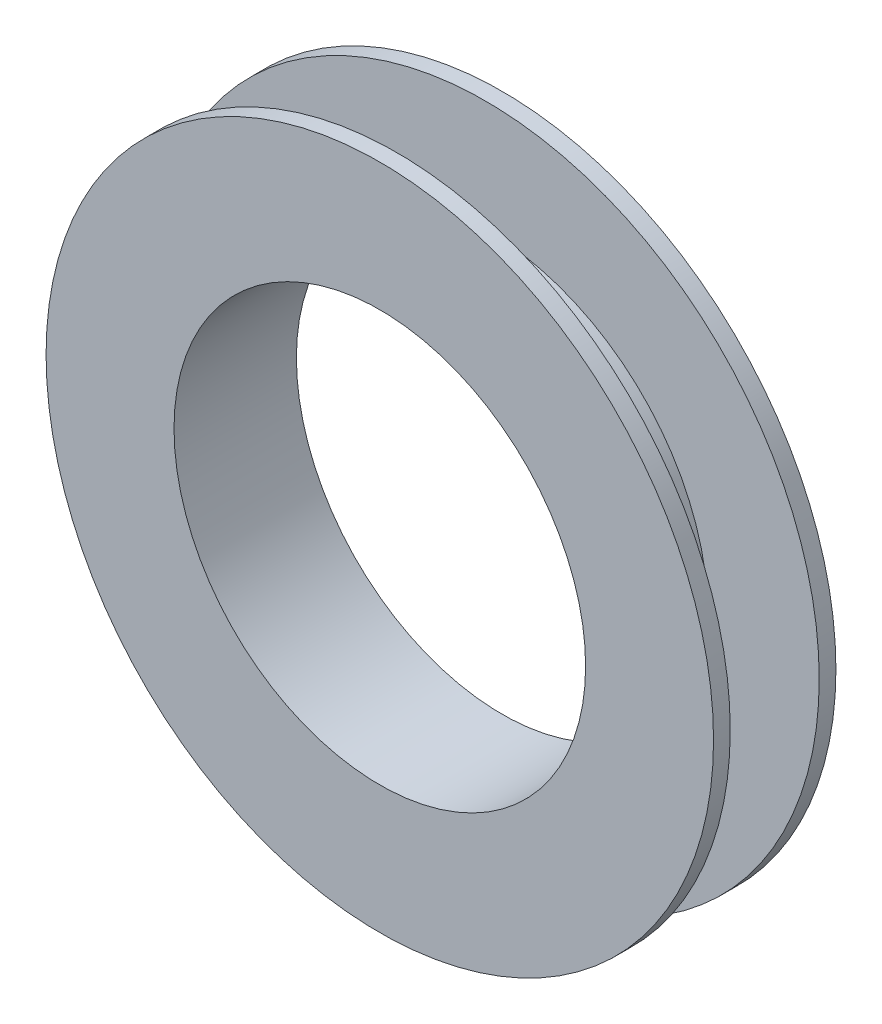
ISO-10303-21;
HEADER;
FILE_DESCRIPTION(('STEP AP214'),'2;1');
FILE_NAME('part.step','',(''),(''),'','','');
FILE_SCHEMA(('AUTOMOTIVE_DESIGN { 1 0 10303 214 1 1 1 1 }'));
ENDSEC;
DATA;
#1=APPLICATION_CONTEXT('core data for automotive mechanical design processes');
#2=APPLICATION_PROTOCOL_DEFINITION('international standard','automotive_design',2000,#1);
#3=PRODUCT_CONTEXT('',#1,'mechanical');
#4=PRODUCT('Part','Part','',(#3));
#5=PRODUCT_RELATED_PRODUCT_CATEGORY('part','',(#4));
#6=PRODUCT_DEFINITION_FORMATION('','',#4);
#7=PRODUCT_DEFINITION_CONTEXT('part definition',#1,'design');
#8=PRODUCT_DEFINITION('design','',#6,#7);
#9=PRODUCT_DEFINITION_SHAPE('','',#8);
#10=(LENGTH_UNIT() NAMED_UNIT(*) SI_UNIT(.MILLI.,.METRE.));
#11=(NAMED_UNIT(*) PLANE_ANGLE_UNIT() SI_UNIT($,.RADIAN.));
#12=(NAMED_UNIT(*) SI_UNIT($,.STERADIAN.) SOLID_ANGLE_UNIT());
#13=UNCERTAINTY_MEASURE_WITH_UNIT(LENGTH_MEASURE(1.E-05),#10,'distance_accuracy_value','');
#14=(GEOMETRIC_REPRESENTATION_CONTEXT(3) GLOBAL_UNCERTAINTY_ASSIGNED_CONTEXT((#13)) GLOBAL_UNIT_ASSIGNED_CONTEXT((#10,
#11,#12)) REPRESENTATION_CONTEXT('',''));
#15=CARTESIAN_POINT('',(0.,0.,0.));
#16=DIRECTION('',(0.,0.,1.));
#17=DIRECTION('',(1.,0.,0.));
#18=AXIS2_PLACEMENT_3D('',#15,#16,#17);
#19=CARTESIAN_POINT('',(25.,0.,-4.));
#20=DIRECTION('',(0.,0.,1.));
#21=DIRECTION('',(1.,0.,0.));
#22=AXIS2_PLACEMENT_3D('',#19,#20,#21);
#23=PLANE('',#22);
#24=CARTESIAN_POINT('',(0.,0.,-4.));
#25=DIRECTION('',(0.,0.,-1.));
#26=DIRECTION('',(-1.,0.,0.));
#27=AXIS2_PLACEMENT_3D('',#24,#25,#26);
#28=CIRCLE('',#27,30.);
#29=CARTESIAN_POINT('',(-30.,0.,-4.));
#30=VERTEX_POINT('',#29);
#31=EDGE_CURVE('E17',#30,#30,#28,.T.);
#32=ORIENTED_EDGE('',*,*,#31,.F.);
#33=EDGE_LOOP('',(#32));
#34=FACE_BOUND('',#33,.T.);
#35=CARTESIAN_POINT('',(0.,0.,-4.));
#36=DIRECTION('',(0.,0.,-1.));
#37=DIRECTION('',(-1.,0.,0.));
#38=AXIS2_PLACEMENT_3D('',#35,#36,#37);
#39=CIRCLE('',#38,20.);
#40=CARTESIAN_POINT('',(-20.,0.,-4.));
#41=VERTEX_POINT('',#40);
#42=EDGE_CURVE('E39',#41,#41,#39,.F.);
#43=ORIENTED_EDGE('',*,*,#42,.F.);
#44=EDGE_LOOP('',(#43));
#45=FACE_BOUND('',#44,.T.);
#46=ADVANCED_FACE('F14',(#34,#45),#23,.T.);
#47=CARTESIAN_POINT('',(0.,0.,-4.75));
#48=DIRECTION('',(0.,0.,-1.));
#49=DIRECTION('',(-1.,0.,0.));
#50=AXIS2_PLACEMENT_3D('',#47,#48,#49);
#51=CYLINDRICAL_SURFACE('',#50,30.);
#52=ORIENTED_EDGE('',*,*,#31,.T.);
#53=EDGE_LOOP('',(#52));
#54=FACE_BOUND('',#53,.T.);
#55=CARTESIAN_POINT('',(0.,0.,-5.5));
#56=DIRECTION('',(0.,0.,-1.));
#57=DIRECTION('',(-1.,0.,0.));
#58=AXIS2_PLACEMENT_3D('',#55,#56,#57);
#59=CIRCLE('',#58,30.);
#60=CARTESIAN_POINT('',(-30.,0.,-5.5));
#61=VERTEX_POINT('',#60);
#62=EDGE_CURVE('E37',#61,#61,#59,.T.);
#63=ORIENTED_EDGE('',*,*,#62,.F.);
#64=EDGE_LOOP('',(#63));
#65=FACE_BOUND('',#64,.T.);
#66=ADVANCED_FACE('F46',(#54,#65),#51,.T.);
#67=CARTESIAN_POINT('',(0.,0.,0.));
#68=DIRECTION('',(0.,0.,-1.));
#69=DIRECTION('',(-1.,0.,0.));
#70=AXIS2_PLACEMENT_3D('',#67,#68,#69);
#71=CYLINDRICAL_SURFACE('',#70,20.);
#72=CARTESIAN_POINT('',(0.,0.,4.));
#73=DIRECTION('',(0.,0.,-1.));
#74=DIRECTION('',(-1.,0.,0.));
#75=AXIS2_PLACEMENT_3D('',#72,#73,#74);
#76=CIRCLE('',#75,20.);
#77=CARTESIAN_POINT('',(-20.,0.,4.));
#78=VERTEX_POINT('',#77);
#79=EDGE_CURVE('E34',#78,#78,#76,.F.);
#80=ORIENTED_EDGE('',*,*,#79,.F.);
#81=EDGE_LOOP('',(#80));
#82=FACE_BOUND('',#81,.T.);
#83=ORIENTED_EDGE('',*,*,#42,.T.);
#84=EDGE_LOOP('',(#83));
#85=FACE_BOUND('',#84,.T.);
#86=ADVANCED_FACE('F55',(#82,#85),#71,.T.);
#87=CARTESIAN_POINT('',(24.25,0.,-5.5));
#88=DIRECTION('',(0.,0.,-1.));
#89=DIRECTION('',(-1.,0.,0.));
#90=AXIS2_PLACEMENT_3D('',#87,#88,#89);
#91=PLANE('',#90);
#92=CARTESIAN_POINT('',(0.,0.,-5.5));
#93=DIRECTION('',(0.,0.,-1.));
#94=DIRECTION('',(-1.,0.,0.));
#95=AXIS2_PLACEMENT_3D('',#92,#93,#94);
#96=CIRCLE('',#95,18.5);
#97=CARTESIAN_POINT('',(-18.5,0.,-5.5));
#98=VERTEX_POINT('',#97);
#99=EDGE_CURVE('E31',#98,#98,#96,.F.);
#100=ORIENTED_EDGE('',*,*,#99,.T.);
#101=EDGE_LOOP('',(#100));
#102=FACE_BOUND('',#101,.T.);
#103=ORIENTED_EDGE('',*,*,#62,.T.);
#104=EDGE_LOOP('',(#103));
#105=FACE_BOUND('',#104,.T.);
#106=ADVANCED_FACE('F74',(#102,#105),#91,.T.);
#107=CARTESIAN_POINT('',(25.,0.,4.));
#108=DIRECTION('',(0.,0.,-1.));
#109=DIRECTION('',(-1.,0.,0.));
#110=AXIS2_PLACEMENT_3D('',#107,#108,#109);
#111=PLANE('',#110);
#112=ORIENTED_EDGE('',*,*,#79,.T.);
#113=EDGE_LOOP('',(#112));
#114=FACE_BOUND('',#113,.T.);
#115=CARTESIAN_POINT('',(0.,0.,4.));
#116=DIRECTION('',(0.,0.,-1.));
#117=DIRECTION('',(-1.,0.,0.));
#118=AXIS2_PLACEMENT_3D('',#115,#116,#117);
#119=CIRCLE('',#118,30.);
#120=CARTESIAN_POINT('',(-30.,0.,4.));
#121=VERTEX_POINT('',#120);
#122=EDGE_CURVE('E26',#121,#121,#119,.F.);
#123=ORIENTED_EDGE('',*,*,#122,.F.);
#124=EDGE_LOOP('',(#123));
#125=FACE_BOUND('',#124,.T.);
#126=ADVANCED_FACE('F70',(#114,#125),#111,.T.);
#127=CARTESIAN_POINT('',(0.,0.,0.));
#128=DIRECTION('',(0.,0.,-1.));
#129=DIRECTION('',(-1.,0.,0.));
#130=AXIS2_PLACEMENT_3D('',#127,#128,#129);
#131=CYLINDRICAL_SURFACE('',#130,18.5);
#132=ORIENTED_EDGE('',*,*,#99,.F.);
#133=EDGE_LOOP('',(#132));
#134=FACE_BOUND('',#133,.T.);
#135=CARTESIAN_POINT('',(0.,0.,5.5));
#136=DIRECTION('',(0.,0.,-1.));
#137=DIRECTION('',(-1.,0.,0.));
#138=AXIS2_PLACEMENT_3D('',#135,#136,#137);
#139=CIRCLE('',#138,18.5);
#140=CARTESIAN_POINT('',(-18.5,0.,5.5));
#141=VERTEX_POINT('',#140);
#142=EDGE_CURVE('E21',#141,#141,#139,.T.);
#143=ORIENTED_EDGE('',*,*,#142,.F.);
#144=EDGE_LOOP('',(#143));
#145=FACE_BOUND('',#144,.T.);
#146=ADVANCED_FACE('F63',(#134,#145),#131,.F.);
#147=CARTESIAN_POINT('',(0.,0.,4.75));
#148=DIRECTION('',(0.,0.,-1.));
#149=DIRECTION('',(-1.,0.,0.));
#150=AXIS2_PLACEMENT_3D('',#147,#148,#149);
#151=CYLINDRICAL_SURFACE('',#150,30.);
#152=CARTESIAN_POINT('',(0.,0.,5.5));
#153=DIRECTION('',(0.,0.,-1.));
#154=DIRECTION('',(-1.,0.,0.));
#155=AXIS2_PLACEMENT_3D('',#152,#153,#154);
#156=CIRCLE('',#155,30.);
#157=CARTESIAN_POINT('',(-30.,0.,5.5));
#158=VERTEX_POINT('',#157);
#159=EDGE_CURVE('E10',#158,#158,#156,.F.);
#160=ORIENTED_EDGE('',*,*,#159,.F.);
#161=EDGE_LOOP('',(#160));
#162=FACE_BOUND('',#161,.T.);
#163=ORIENTED_EDGE('',*,*,#122,.T.);
#164=EDGE_LOOP('',(#163));
#165=FACE_BOUND('',#164,.T.);
#166=ADVANCED_FACE('F58',(#162,#165),#151,.T.);
#167=CARTESIAN_POINT('',(24.25,0.,5.5));
#168=DIRECTION('',(0.,0.,1.));
#169=DIRECTION('',(1.,0.,0.));
#170=AXIS2_PLACEMENT_3D('',#167,#168,#169);
#171=PLANE('',#170);
#172=ORIENTED_EDGE('',*,*,#159,.T.);
#173=EDGE_LOOP('',(#172));
#174=FACE_BOUND('',#173,.T.);
#175=ORIENTED_EDGE('',*,*,#142,.T.);
#176=EDGE_LOOP('',(#175));
#177=FACE_BOUND('',#176,.T.);
#178=ADVANCED_FACE('F56',(#174,#177),#171,.T.);
#179=CLOSED_SHELL('',(#46,#66,#86,#106,#126,#146,#166,#178));
#180=MANIFOLD_SOLID_BREP('B1',#179);
#181=ADVANCED_BREP_SHAPE_REPRESENTATION('',(#18,#180),#14);
#182=SHAPE_DEFINITION_REPRESENTATION(#9,#181);
ENDSEC;
END-ISO-10303-21;
